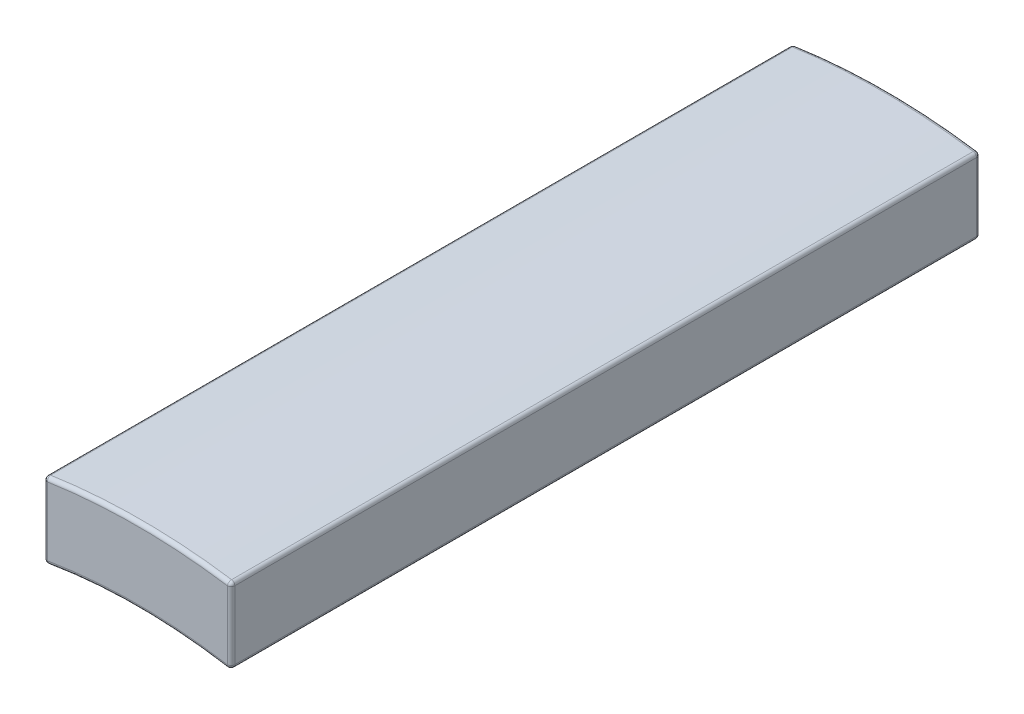
ISO-10303-21;
HEADER;
FILE_DESCRIPTION(('STEP AP214'),'2;1');
FILE_NAME('part.step','',(''),(''),'','','');
FILE_SCHEMA(('AUTOMOTIVE_DESIGN { 1 0 10303 214 1 1 1 1 }'));
ENDSEC;
DATA;
#1=APPLICATION_CONTEXT('core data for automotive mechanical design processes');
#2=APPLICATION_PROTOCOL_DEFINITION('international standard','automotive_design',2000,#1);
#3=PRODUCT_CONTEXT('',#1,'mechanical');
#4=PRODUCT('Part','Part','',(#3));
#5=PRODUCT_RELATED_PRODUCT_CATEGORY('part','',(#4));
#6=PRODUCT_DEFINITION_FORMATION('','',#4);
#7=PRODUCT_DEFINITION_CONTEXT('part definition',#1,'design');
#8=PRODUCT_DEFINITION('design','',#6,#7);
#9=PRODUCT_DEFINITION_SHAPE('','',#8);
#10=(LENGTH_UNIT() NAMED_UNIT(*) SI_UNIT(.MILLI.,.METRE.));
#11=(NAMED_UNIT(*) PLANE_ANGLE_UNIT() SI_UNIT($,.RADIAN.));
#12=(NAMED_UNIT(*) SI_UNIT($,.STERADIAN.) SOLID_ANGLE_UNIT());
#13=UNCERTAINTY_MEASURE_WITH_UNIT(LENGTH_MEASURE(1.E-05),#10,'distance_accuracy_value','');
#14=(GEOMETRIC_REPRESENTATION_CONTEXT(3) GLOBAL_UNCERTAINTY_ASSIGNED_CONTEXT((#13)) GLOBAL_UNIT_ASSIGNED_CONTEXT((#10,
#11,#12)) REPRESENTATION_CONTEXT('',''));
#15=CARTESIAN_POINT('',(0.,0.,0.));
#16=DIRECTION('',(0.,0.,1.));
#17=DIRECTION('',(1.,0.,0.));
#18=AXIS2_PLACEMENT_3D('',#15,#16,#17);
#19=CARTESIAN_POINT('',(2.4,14.3,0.1));
#20=DIRECTION('',(0.,1.,0.));
#21=DIRECTION('',(0.,0.,1.));
#22=AXIS2_PLACEMENT_3D('',#19,#20,#21);
#23=CYLINDRICAL_SURFACE('',#22,0.1);
#24=CARTESIAN_POINT('',(2.4,14.3,0.1));
#25=DIRECTION('',(0.,1.,0.));
#26=DIRECTION('',(0.,0.,1.));
#27=AXIS2_PLACEMENT_3D('',#24,#25,#26);
#28=CIRCLE('',#27,0.1);
#29=CARTESIAN_POINT('',(2.5,14.3,0.1));
#30=VERTEX_POINT('',#29);
#31=CARTESIAN_POINT('',(2.4,14.3,0.));
#32=VERTEX_POINT('',#31);
#33=EDGE_CURVE('E27',#30,#32,#28,.T.);
#34=ORIENTED_EDGE('',*,*,#33,.T.);
#35=DIRECTION('',(0.,-1.,0.));
#36=VECTOR('',#35,1.);
#37=CARTESIAN_POINT('',(2.4,14.3,0.));
#38=LINE('',#37,#36);
#39=CARTESIAN_POINT('',(2.4,16.1223447426235,0.));
#40=VERTEX_POINT('',#39);
#41=EDGE_CURVE('E218',#40,#32,#38,.T.);
#42=ORIENTED_EDGE('',*,*,#41,.F.);
#43=CARTESIAN_POINT('',(2.4,16.1223447426235,0.1));
#44=DIRECTION('',(0.,-1.,0.));
#45=DIRECTION('',(0.,0.,-1.));
#46=AXIS2_PLACEMENT_3D('',#43,#44,#45);
#47=CIRCLE('',#46,0.1);
#48=CARTESIAN_POINT('',(2.5,16.1223447426235,0.1));
#49=VERTEX_POINT('',#48);
#50=EDGE_CURVE('E11',#40,#49,#47,.T.);
#51=ORIENTED_EDGE('',*,*,#50,.T.);
#52=DIRECTION('',(0.,1.,0.));
#53=VECTOR('',#52,1.);
#54=CARTESIAN_POINT('',(2.5,14.3,0.1));
#55=LINE('',#54,#53);
#56=EDGE_CURVE('E275',#30,#49,#55,.T.);
#57=ORIENTED_EDGE('',*,*,#56,.F.);
#58=EDGE_LOOP('',(#34,#42,#51,#57));
#59=FACE_BOUND('',#58,.T.);
#60=ADVANCED_FACE('F16',(#59),#23,.T.);
#61=CARTESIAN_POINT('',(2.4,16.1223447426235,0.1));
#62=DIRECTION('',(0.,1.,0.));
#63=DIRECTION('',(1.,0.,0.));
#64=AXIS2_PLACEMENT_3D('',#61,#62,#63);
#65=SPHERICAL_SURFACE('',#64,0.1);
#66=CARTESIAN_POINT('',(2.4,16.1223447426235,0.1));
#67=DIRECTION('',(0.98910090445543,-0.147239263803684,0.));
#68=DIRECTION('',(0.147239263803684,0.98910090445543,0.));
#69=AXIS2_PLACEMENT_3D('',#66,#67,#68);
#70=CIRCLE('',#69,0.1);
#71=CARTESIAN_POINT('',(2.41472392638037,16.2212548330691,0.1));
#72=VERTEX_POINT('',#71);
#73=EDGE_CURVE('E155',#40,#72,#70,.T.);
#74=ORIENTED_EDGE('',*,*,#73,.T.);
#75=CARTESIAN_POINT('',(2.4,16.1223447426235,0.1));
#76=DIRECTION('',(0.,0.,1.));
#77=DIRECTION('',(-1.,0.,0.));
#78=AXIS2_PLACEMENT_3D('',#75,#76,#77);
#79=CIRCLE('',#78,0.1);
#80=EDGE_CURVE('E208',#49,#72,#79,.T.);
#81=ORIENTED_EDGE('',*,*,#80,.F.);
#82=ORIENTED_EDGE('',*,*,#50,.F.);
#83=EDGE_LOOP('',(#74,#81,#82));
#84=FACE_BOUND('',#83,.T.);
#85=ADVANCED_FACE('F636',(#84),#65,.T.);
#86=CARTESIAN_POINT('',(2.4,14.3,0.1));
#87=DIRECTION('',(0.,1.,0.));
#88=DIRECTION('',(1.,0.,0.));
#89=AXIS2_PLACEMENT_3D('',#86,#87,#88);
#90=SPHERICAL_SURFACE('',#89,0.1);
#91=CARTESIAN_POINT('',(2.4,14.3,0.1));
#92=DIRECTION('',(0.,0.,1.));
#93=DIRECTION('',(-1.,0.,0.));
#94=AXIS2_PLACEMENT_3D('',#91,#92,#93);
#95=CIRCLE('',#94,0.1);
#96=CARTESIAN_POINT('',(2.38344827586207,14.2013793103448,0.1));
#97=VERTEX_POINT('',#96);
#98=EDGE_CURVE('E172',#97,#30,#95,.T.);
#99=ORIENTED_EDGE('',*,*,#98,.F.);
#100=CARTESIAN_POINT('',(2.4,14.3,0.1));
#101=DIRECTION('',(0.986206896551724,-0.165517241379312,0.));
#102=DIRECTION('',(0.165517241379312,0.986206896551724,0.));
#103=AXIS2_PLACEMENT_3D('',#100,#101,#102);
#104=CIRCLE('',#103,0.1);
#105=EDGE_CURVE('E144',#97,#32,#104,.T.);
#106=ORIENTED_EDGE('',*,*,#105,.T.);
#107=ORIENTED_EDGE('',*,*,#33,.F.);
#108=EDGE_LOOP('',(#99,#106,#107));
#109=FACE_BOUND('',#108,.T.);
#110=ADVANCED_FACE('F173',(#109),#90,.T.);
#111=CARTESIAN_POINT('',(0.,0.,0.1));
#112=DIRECTION('',(0.,0.,1.));
#113=DIRECTION('',(1.,0.,0.));
#114=AXIS2_PLACEMENT_3D('',#111,#112,#113);
#115=TOROIDAL_SURFACE('',#114,16.3,0.1);
#116=CARTESIAN_POINT('',(-2.4,16.1223447426235,0.1));
#117=DIRECTION('',(0.98910090445543,0.14723926380368,0.));
#118=DIRECTION('',(-0.14723926380368,0.98910090445543,0.));
#119=AXIS2_PLACEMENT_3D('',#116,#117,#118);
#120=CIRCLE('',#119,0.1);
#121=CARTESIAN_POINT('',(-2.4,16.1223447426235,0.));
#122=VERTEX_POINT('',#121);
#123=CARTESIAN_POINT('',(-2.41472392638037,16.2212548330691,0.1));
#124=VERTEX_POINT('',#123);
#125=EDGE_CURVE('E156',#122,#124,#120,.T.);
#126=ORIENTED_EDGE('',*,*,#125,.T.);
#127=CARTESIAN_POINT('',(0.,0.,0.1));
#128=DIRECTION('',(0.,0.,1.));
#129=DIRECTION('',(1.,0.,0.));
#130=AXIS2_PLACEMENT_3D('',#127,#128,#129);
#131=CIRCLE('',#130,16.4);
#132=EDGE_CURVE('E266',#72,#124,#131,.T.);
#133=ORIENTED_EDGE('',*,*,#132,.F.);
#134=ORIENTED_EDGE('',*,*,#73,.F.);
#135=CARTESIAN_POINT('',(0.,0.,0.));
#136=DIRECTION('',(0.,0.,-1.));
#137=DIRECTION('',(1.,0.,0.));
#138=AXIS2_PLACEMENT_3D('',#135,#136,#137);
#139=CIRCLE('',#138,16.3);
#140=EDGE_CURVE('E214',#122,#40,#139,.T.);
#141=ORIENTED_EDGE('',*,*,#140,.F.);
#142=EDGE_LOOP('',(#126,#133,#134,#141));
#143=FACE_BOUND('',#142,.T.);
#144=ADVANCED_FACE('F547',(#143),#115,.T.);
#145=CARTESIAN_POINT('',(0.,0.,0.1));
#146=DIRECTION('',(0.,0.,1.));
#147=DIRECTION('',(1.,0.,0.));
#148=AXIS2_PLACEMENT_3D('',#145,#146,#147);
#149=TOROIDAL_SURFACE('',#148,14.5,0.1);
#150=CARTESIAN_POINT('',(-2.4,14.3,0.1));
#151=DIRECTION('',(0.986206896551723,0.165517241379316,0.));
#152=DIRECTION('',(-0.165517241379316,0.986206896551723,0.));
#153=AXIS2_PLACEMENT_3D('',#150,#151,#152);
#154=CIRCLE('',#153,0.1);
#155=CARTESIAN_POINT('',(-2.38344827586207,14.2013793103448,0.1));
#156=VERTEX_POINT('',#155);
#157=CARTESIAN_POINT('',(-2.4,14.3,0.));
#158=VERTEX_POINT('',#157);
#159=EDGE_CURVE('E20',#156,#158,#154,.T.);
#160=ORIENTED_EDGE('',*,*,#159,.T.);
#161=CARTESIAN_POINT('',(0.,0.,0.));
#162=DIRECTION('',(0.,0.,1.));
#163=DIRECTION('',(1.,0.,0.));
#164=AXIS2_PLACEMENT_3D('',#161,#162,#163);
#165=CIRCLE('',#164,14.5);
#166=EDGE_CURVE('E150',#32,#158,#165,.T.);
#167=ORIENTED_EDGE('',*,*,#166,.F.);
#168=ORIENTED_EDGE('',*,*,#105,.F.);
#169=CARTESIAN_POINT('',(0.,0.,0.1));
#170=DIRECTION('',(0.,0.,-1.));
#171=DIRECTION('',(1.,0.,0.));
#172=AXIS2_PLACEMENT_3D('',#169,#170,#171);
#173=CIRCLE('',#172,14.4);
#174=EDGE_CURVE('E147',#156,#97,#173,.T.);
#175=ORIENTED_EDGE('',*,*,#174,.F.);
#176=EDGE_LOOP('',(#160,#167,#168,#175));
#177=FACE_BOUND('',#176,.T.);
#178=ADVANCED_FACE('F146',(#177),#149,.T.);
#179=CARTESIAN_POINT('',(-2.4,16.1223447426235,0.1));
#180=DIRECTION('',(0.,1.,0.));
#181=DIRECTION('',(1.,0.,0.));
#182=AXIS2_PLACEMENT_3D('',#179,#180,#181);
#183=SPHERICAL_SURFACE('',#182,0.1);
#184=CARTESIAN_POINT('',(-2.4,16.1223447426235,0.1));
#185=DIRECTION('',(0.,1.,0.));
#186=DIRECTION('',(0.,0.,1.));
#187=AXIS2_PLACEMENT_3D('',#184,#185,#186);
#188=CIRCLE('',#187,0.1);
#189=CARTESIAN_POINT('',(-2.5,16.1223447426235,0.1));
#190=VERTEX_POINT('',#189);
#191=EDGE_CURVE('E250',#122,#190,#188,.T.);
#192=ORIENTED_EDGE('',*,*,#191,.T.);
#193=CARTESIAN_POINT('',(-2.4,16.1223447426235,0.1));
#194=DIRECTION('',(0.,0.,1.));
#195=DIRECTION('',(-1.,0.,0.));
#196=AXIS2_PLACEMENT_3D('',#193,#194,#195);
#197=CIRCLE('',#196,0.1);
#198=EDGE_CURVE('E226',#124,#190,#197,.T.);
#199=ORIENTED_EDGE('',*,*,#198,.F.);
#200=ORIENTED_EDGE('',*,*,#125,.F.);
#201=EDGE_LOOP('',(#192,#199,#200));
#202=FACE_BOUND('',#201,.T.);
#203=ADVANCED_FACE('F560',(#202),#183,.T.);
#204=CARTESIAN_POINT('',(-2.4,14.3,0.1));
#205=DIRECTION('',(0.,1.,0.));
#206=DIRECTION('',(1.,0.,0.));
#207=AXIS2_PLACEMENT_3D('',#204,#205,#206);
#208=SPHERICAL_SURFACE('',#207,0.1);
#209=CARTESIAN_POINT('',(-2.4,14.3,0.1));
#210=DIRECTION('',(0.,0.,1.));
#211=DIRECTION('',(-1.,0.,0.));
#212=AXIS2_PLACEMENT_3D('',#209,#210,#211);
#213=CIRCLE('',#212,0.1);
#214=CARTESIAN_POINT('',(-2.5,14.3,0.1));
#215=VERTEX_POINT('',#214);
#216=EDGE_CURVE('E243',#215,#156,#213,.T.);
#217=ORIENTED_EDGE('',*,*,#216,.F.);
#218=CARTESIAN_POINT('',(-2.4,14.3,0.1));
#219=DIRECTION('',(0.,-1.,0.));
#220=DIRECTION('',(0.,0.,-1.));
#221=AXIS2_PLACEMENT_3D('',#218,#219,#220);
#222=CIRCLE('',#221,0.1);
#223=EDGE_CURVE('E212',#215,#158,#222,.T.);
#224=ORIENTED_EDGE('',*,*,#223,.T.);
#225=ORIENTED_EDGE('',*,*,#159,.F.);
#226=EDGE_LOOP('',(#217,#224,#225));
#227=FACE_BOUND('',#226,.T.);
#228=ADVANCED_FACE('F346',(#227),#208,.T.);
#229=CARTESIAN_POINT('',(-2.4,14.3,0.1));
#230=DIRECTION('',(0.,-1.,0.));
#231=DIRECTION('',(0.,0.,-1.));
#232=AXIS2_PLACEMENT_3D('',#229,#230,#231);
#233=CYLINDRICAL_SURFACE('',#232,0.1);
#234=ORIENTED_EDGE('',*,*,#223,.F.);
#235=DIRECTION('',(0.,-1.,0.));
#236=VECTOR('',#235,1.);
#237=CARTESIAN_POINT('',(-2.5,14.3,0.1));
#238=LINE('',#237,#236);
#239=EDGE_CURVE('E249',#190,#215,#238,.T.);
#240=ORIENTED_EDGE('',*,*,#239,.F.);
#241=ORIENTED_EDGE('',*,*,#191,.F.);
#242=DIRECTION('',(0.,1.,0.));
#243=VECTOR('',#242,1.);
#244=CARTESIAN_POINT('',(-2.4,14.3,0.));
#245=LINE('',#244,#243);
#246=EDGE_CURVE('E197',#158,#122,#245,.T.);
#247=ORIENTED_EDGE('',*,*,#246,.F.);
#248=EDGE_LOOP('',(#234,#240,#241,#247));
#249=FACE_BOUND('',#248,.T.);
#250=ADVANCED_FACE('F559',(#249),#233,.T.);
#251=CARTESIAN_POINT('',(0.,0.,19.9));
#252=DIRECTION('',(0.,0.,1.));
#253=DIRECTION('',(1.,0.,0.));
#254=AXIS2_PLACEMENT_3D('',#251,#252,#253);
#255=TOROIDAL_SURFACE('',#254,14.5,0.1);
#256=CARTESIAN_POINT('',(-2.4,14.3,19.9));
#257=DIRECTION('',(0.986206896551723,0.165517241379316,0.));
#258=DIRECTION('',(-0.165517241379316,0.986206896551723,0.));
#259=AXIS2_PLACEMENT_3D('',#256,#257,#258);
#260=CIRCLE('',#259,0.1);
#261=CARTESIAN_POINT('',(-2.4,14.3,20.));
#262=VERTEX_POINT('',#261);
#263=CARTESIAN_POINT('',(-2.38344827586207,14.2013793103448,19.9));
#264=VERTEX_POINT('',#263);
#265=EDGE_CURVE('E213',#262,#264,#260,.T.);
#266=ORIENTED_EDGE('',*,*,#265,.T.);
#267=CARTESIAN_POINT('',(0.,0.,19.9));
#268=DIRECTION('',(0.,0.,1.));
#269=DIRECTION('',(1.,0.,0.));
#270=AXIS2_PLACEMENT_3D('',#267,#268,#269);
#271=CIRCLE('',#270,14.4);
#272=CARTESIAN_POINT('',(2.38344827586207,14.2013793103448,19.9));
#273=VERTEX_POINT('',#272);
#274=EDGE_CURVE('E168',#273,#264,#271,.T.);
#275=ORIENTED_EDGE('',*,*,#274,.F.);
#276=CARTESIAN_POINT('',(2.4,14.3,19.9));
#277=DIRECTION('',(-0.986206896551725,0.165517241379303,0.));
#278=DIRECTION('',(-0.165517241379303,-0.986206896551725,0.));
#279=AXIS2_PLACEMENT_3D('',#276,#277,#278);
#280=CIRCLE('',#279,0.1);
#281=CARTESIAN_POINT('',(2.4,14.3,20.));
#282=VERTEX_POINT('',#281);
#283=EDGE_CURVE('E75',#273,#282,#280,.T.);
#284=ORIENTED_EDGE('',*,*,#283,.T.);
#285=CARTESIAN_POINT('',(0.,0.,20.));
#286=DIRECTION('',(0.,0.,-1.));
#287=DIRECTION('',(1.,0.,0.));
#288=AXIS2_PLACEMENT_3D('',#285,#286,#287);
#289=CIRCLE('',#288,14.5);
#290=EDGE_CURVE('E198',#262,#282,#289,.T.);
#291=ORIENTED_EDGE('',*,*,#290,.F.);
#292=EDGE_LOOP('',(#266,#275,#284,#291));
#293=FACE_BOUND('',#292,.T.);
#294=ADVANCED_FACE('F340',(#293),#255,.T.);
#295=CARTESIAN_POINT('',(2.4,14.3,19.9));
#296=DIRECTION('',(0.,1.,0.));
#297=DIRECTION('',(1.,0.,0.));
#298=AXIS2_PLACEMENT_3D('',#295,#296,#297);
#299=SPHERICAL_SURFACE('',#298,0.1);
#300=CARTESIAN_POINT('',(2.4,14.3,19.9));
#301=DIRECTION('',(0.,0.,-1.));
#302=DIRECTION('',(-1.,0.,0.));
#303=AXIS2_PLACEMENT_3D('',#300,#301,#302);
#304=CIRCLE('',#303,0.1);
#305=CARTESIAN_POINT('',(2.5,14.3,19.9));
#306=VERTEX_POINT('',#305);
#307=EDGE_CURVE('E183',#306,#273,#304,.T.);
#308=ORIENTED_EDGE('',*,*,#307,.F.);
#309=CARTESIAN_POINT('',(2.4,14.3,19.9));
#310=DIRECTION('',(0.,-1.,0.));
#311=DIRECTION('',(0.,0.,-1.));
#312=AXIS2_PLACEMENT_3D('',#309,#310,#311);
#313=CIRCLE('',#312,0.1);
#314=EDGE_CURVE('E234',#306,#282,#313,.T.);
#315=ORIENTED_EDGE('',*,*,#314,.T.);
#316=ORIENTED_EDGE('',*,*,#283,.F.);
#317=EDGE_LOOP('',(#308,#315,#316));
#318=FACE_BOUND('',#317,.T.);
#319=ADVANCED_FACE('F685',(#318),#299,.T.);
#320=CARTESIAN_POINT('',(-2.4,14.3,19.9));
#321=DIRECTION('',(0.,1.,0.));
#322=DIRECTION('',(1.,0.,0.));
#323=AXIS2_PLACEMENT_3D('',#320,#321,#322);
#324=SPHERICAL_SURFACE('',#323,0.1);
#325=CARTESIAN_POINT('',(-2.4,14.3,19.9));
#326=DIRECTION('',(0.,-1.,0.));
#327=DIRECTION('',(0.,0.,-1.));
#328=AXIS2_PLACEMENT_3D('',#325,#326,#327);
#329=CIRCLE('',#328,0.1);
#330=CARTESIAN_POINT('',(-2.5,14.3,19.9));
#331=VERTEX_POINT('',#330);
#332=EDGE_CURVE('E257',#262,#331,#329,.T.);
#333=ORIENTED_EDGE('',*,*,#332,.T.);
#334=CARTESIAN_POINT('',(-2.4,14.3,19.9));
#335=DIRECTION('',(0.,0.,-1.));
#336=DIRECTION('',(-1.,0.,0.));
#337=AXIS2_PLACEMENT_3D('',#334,#335,#336);
#338=CIRCLE('',#337,0.1);
#339=EDGE_CURVE('E169',#264,#331,#338,.T.);
#340=ORIENTED_EDGE('',*,*,#339,.F.);
#341=ORIENTED_EDGE('',*,*,#265,.F.);
#342=EDGE_LOOP('',(#333,#340,#341));
#343=FACE_BOUND('',#342,.T.);
#344=ADVANCED_FACE('F341',(#343),#324,.T.);
#345=CARTESIAN_POINT('',(2.4,14.3,19.9));
#346=DIRECTION('',(0.,-1.,0.));
#347=DIRECTION('',(0.,0.,-1.));
#348=AXIS2_PLACEMENT_3D('',#345,#346,#347);
#349=CYLINDRICAL_SURFACE('',#348,0.1);
#350=CARTESIAN_POINT('',(2.4,16.1223447426235,19.9));
#351=DIRECTION('',(0.,-1.,0.));
#352=DIRECTION('',(0.,0.,-1.));
#353=AXIS2_PLACEMENT_3D('',#350,#351,#352);
#354=CIRCLE('',#353,0.1);
#355=CARTESIAN_POINT('',(2.5,16.1223447426235,19.9));
#356=VERTEX_POINT('',#355);
#357=CARTESIAN_POINT('',(2.4,16.1223447426235,20.));
#358=VERTEX_POINT('',#357);
#359=EDGE_CURVE('E58',#356,#358,#354,.T.);
#360=ORIENTED_EDGE('',*,*,#359,.T.);
#361=DIRECTION('',(0.,1.,0.));
#362=VECTOR('',#361,1.);
#363=CARTESIAN_POINT('',(2.4,16.1223447426235,20.));
#364=LINE('',#363,#362);
#365=EDGE_CURVE('E202',#282,#358,#364,.T.);
#366=ORIENTED_EDGE('',*,*,#365,.F.);
#367=ORIENTED_EDGE('',*,*,#314,.F.);
#368=DIRECTION('',(0.,-1.,0.));
#369=VECTOR('',#368,1.);
#370=CARTESIAN_POINT('',(2.5,14.3,19.9));
#371=LINE('',#370,#369);
#372=EDGE_CURVE('E204',#356,#306,#371,.T.);
#373=ORIENTED_EDGE('',*,*,#372,.F.);
#374=EDGE_LOOP('',(#360,#366,#367,#373));
#375=FACE_BOUND('',#374,.T.);
#376=ADVANCED_FACE('F645',(#375),#349,.T.);
#377=CARTESIAN_POINT('',(-2.4,14.3,19.9));
#378=DIRECTION('',(0.,1.,0.));
#379=DIRECTION('',(0.,0.,1.));
#380=AXIS2_PLACEMENT_3D('',#377,#378,#379);
#381=CYLINDRICAL_SURFACE('',#380,0.1);
#382=CARTESIAN_POINT('',(-2.4,16.1223447426235,19.9));
#383=DIRECTION('',(0.,-1.,0.));
#384=DIRECTION('',(0.,0.,-1.));
#385=AXIS2_PLACEMENT_3D('',#382,#383,#384);
#386=CIRCLE('',#385,0.1);
#387=CARTESIAN_POINT('',(-2.4,16.1223447426235,20.));
#388=VERTEX_POINT('',#387);
#389=CARTESIAN_POINT('',(-2.5,16.1223447426235,19.9));
#390=VERTEX_POINT('',#389);
#391=EDGE_CURVE('E192',#388,#390,#386,.T.);
#392=ORIENTED_EDGE('',*,*,#391,.T.);
#393=DIRECTION('',(0.,1.,0.));
#394=VECTOR('',#393,1.);
#395=CARTESIAN_POINT('',(-2.5,16.1223447426235,19.9));
#396=LINE('',#395,#394);
#397=EDGE_CURVE('E239',#331,#390,#396,.T.);
#398=ORIENTED_EDGE('',*,*,#397,.F.);
#399=ORIENTED_EDGE('',*,*,#332,.F.);
#400=DIRECTION('',(0.,-1.,0.));
#401=VECTOR('',#400,1.);
#402=CARTESIAN_POINT('',(-2.4,14.3,20.));
#403=LINE('',#402,#401);
#404=EDGE_CURVE('E203',#388,#262,#403,.T.);
#405=ORIENTED_EDGE('',*,*,#404,.F.);
#406=EDGE_LOOP('',(#392,#398,#399,#405));
#407=FACE_BOUND('',#406,.T.);
#408=ADVANCED_FACE('F335',(#407),#381,.T.);
#409=CARTESIAN_POINT('',(2.4,16.1223447426235,19.9));
#410=DIRECTION('',(0.,1.,0.));
#411=DIRECTION('',(1.,0.,0.));
#412=AXIS2_PLACEMENT_3D('',#409,#410,#411);
#413=SPHERICAL_SURFACE('',#412,0.1);
#414=CARTESIAN_POINT('',(2.4,16.1223447426235,19.9));
#415=DIRECTION('',(0.,0.,-1.));
#416=DIRECTION('',(-1.,0.,0.));
#417=AXIS2_PLACEMENT_3D('',#414,#415,#416);
#418=CIRCLE('',#417,0.1);
#419=CARTESIAN_POINT('',(2.41472392638037,16.2212548330691,19.9));
#420=VERTEX_POINT('',#419);
#421=EDGE_CURVE('E270',#420,#356,#418,.T.);
#422=ORIENTED_EDGE('',*,*,#421,.F.);
#423=CARTESIAN_POINT('',(2.4,16.1223447426235,19.9));
#424=DIRECTION('',(0.98910090445543,-0.14723926380368,0.));
#425=DIRECTION('',(0.14723926380368,0.98910090445543,0.));
#426=AXIS2_PLACEMENT_3D('',#423,#424,#425);
#427=CIRCLE('',#426,0.1);
#428=EDGE_CURVE('E193',#420,#358,#427,.T.);
#429=ORIENTED_EDGE('',*,*,#428,.T.);
#430=ORIENTED_EDGE('',*,*,#359,.F.);
#431=EDGE_LOOP('',(#422,#429,#430));
#432=FACE_BOUND('',#431,.T.);
#433=ADVANCED_FACE('F627',(#432),#413,.T.);
#434=CARTESIAN_POINT('',(-2.4,16.1223447426235,19.9));
#435=DIRECTION('',(0.,1.,0.));
#436=DIRECTION('',(1.,0.,0.));
#437=AXIS2_PLACEMENT_3D('',#434,#435,#436);
#438=SPHERICAL_SURFACE('',#437,0.1);
#439=CARTESIAN_POINT('',(-2.4,16.1223447426235,19.9));
#440=DIRECTION('',(-0.98910090445543,-0.14723926380368,0.));
#441=DIRECTION('',(0.14723926380368,-0.98910090445543,0.));
#442=AXIS2_PLACEMENT_3D('',#439,#440,#441);
#443=CIRCLE('',#442,0.1);
#444=CARTESIAN_POINT('',(-2.41472392638037,16.2212548330691,19.9));
#445=VERTEX_POINT('',#444);
#446=EDGE_CURVE('E190',#388,#445,#443,.T.);
#447=ORIENTED_EDGE('',*,*,#446,.T.);
#448=CARTESIAN_POINT('',(-2.4,16.1223447426235,19.9));
#449=DIRECTION('',(0.,0.,-1.));
#450=DIRECTION('',(-1.,0.,0.));
#451=AXIS2_PLACEMENT_3D('',#448,#449,#450);
#452=CIRCLE('',#451,0.1);
#453=EDGE_CURVE('E245',#390,#445,#452,.T.);
#454=ORIENTED_EDGE('',*,*,#453,.F.);
#455=ORIENTED_EDGE('',*,*,#391,.F.);
#456=EDGE_LOOP('',(#447,#454,#455));
#457=FACE_BOUND('',#456,.T.);
#458=ADVANCED_FACE('F596',(#457),#438,.T.);
#459=CARTESIAN_POINT('',(0.,0.,19.9));
#460=DIRECTION('',(0.,0.,1.));
#461=DIRECTION('',(1.,0.,0.));
#462=AXIS2_PLACEMENT_3D('',#459,#460,#461);
#463=TOROIDAL_SURFACE('',#462,16.3,0.1);
#464=ORIENTED_EDGE('',*,*,#428,.F.);
#465=CARTESIAN_POINT('',(0.,0.,19.9));
#466=DIRECTION('',(0.,0.,-1.));
#467=DIRECTION('',(1.,0.,0.));
#468=AXIS2_PLACEMENT_3D('',#465,#466,#467);
#469=CIRCLE('',#468,16.4);
#470=EDGE_CURVE('E223',#445,#420,#469,.T.);
#471=ORIENTED_EDGE('',*,*,#470,.F.);
#472=ORIENTED_EDGE('',*,*,#446,.F.);
#473=CARTESIAN_POINT('',(0.,0.,20.));
#474=DIRECTION('',(0.,0.,1.));
#475=DIRECTION('',(1.,0.,0.));
#476=AXIS2_PLACEMENT_3D('',#473,#474,#475);
#477=CIRCLE('',#476,16.3);
#478=EDGE_CURVE('E219',#358,#388,#477,.T.);
#479=ORIENTED_EDGE('',*,*,#478,.F.);
#480=EDGE_LOOP('',(#464,#471,#472,#479));
#481=FACE_BOUND('',#480,.T.);
#482=ADVANCED_FACE('F592',(#481),#463,.T.);
#483=CARTESIAN_POINT('',(2.4,14.3,0.));
#484=DIRECTION('',(0.,0.,1.));
#485=DIRECTION('',(1.,0.,0.));
#486=AXIS2_PLACEMENT_3D('',#483,#484,#485);
#487=PLANE('',#486);
#488=ORIENTED_EDGE('',*,*,#140,.T.);
#489=ORIENTED_EDGE('',*,*,#41,.T.);
#490=ORIENTED_EDGE('',*,*,#166,.T.);
#491=ORIENTED_EDGE('',*,*,#246,.T.);
#492=EDGE_LOOP('',(#488,#489,#490,#491));
#493=FACE_BOUND('',#492,.T.);
#494=ADVANCED_FACE('F578',(#493),#487,.F.);
#495=CARTESIAN_POINT('',(2.4,14.3,20.));
#496=DIRECTION('',(0.,0.,1.));
#497=DIRECTION('',(1.,0.,0.));
#498=AXIS2_PLACEMENT_3D('',#495,#496,#497);
#499=PLANE('',#498);
#500=ORIENTED_EDGE('',*,*,#404,.T.);
#501=ORIENTED_EDGE('',*,*,#290,.T.);
#502=ORIENTED_EDGE('',*,*,#365,.T.);
#503=ORIENTED_EDGE('',*,*,#478,.T.);
#504=EDGE_LOOP('',(#500,#501,#502,#503));
#505=FACE_BOUND('',#504,.T.);
#506=ADVANCED_FACE('F331',(#505),#499,.T.);
#507=CARTESIAN_POINT('',(0.,0.,20.));
#508=DIRECTION('',(0.,0.,-1.));
#509=DIRECTION('',(-1.,0.,0.));
#510=AXIS2_PLACEMENT_3D('',#507,#508,#509);
#511=CYLINDRICAL_SURFACE('',#510,14.4);
#512=DIRECTION('',(0.,0.,-1.));
#513=VECTOR('',#512,1.);
#514=CARTESIAN_POINT('',(-2.38344827586207,14.2013793103448,20.));
#515=LINE('',#514,#513);
#516=EDGE_CURVE('E165',#264,#156,#515,.T.);
#517=ORIENTED_EDGE('',*,*,#516,.T.);
#518=ORIENTED_EDGE('',*,*,#174,.T.);
#519=DIRECTION('',(0.,0.,-1.));
#520=VECTOR('',#519,1.);
#521=CARTESIAN_POINT('',(2.38344827586207,14.2013793103448,20.));
#522=LINE('',#521,#520);
#523=EDGE_CURVE('E163',#273,#97,#522,.T.);
#524=ORIENTED_EDGE('',*,*,#523,.F.);
#525=ORIENTED_EDGE('',*,*,#274,.T.);
#526=EDGE_LOOP('',(#517,#518,#524,#525));
#527=FACE_BOUND('',#526,.T.);
#528=ADVANCED_FACE('F160',(#527),#511,.F.);
#529=CARTESIAN_POINT('',(-2.4,14.3,20.));
#530=DIRECTION('',(0.,0.,-1.));
#531=DIRECTION('',(-1.,0.,0.));
#532=AXIS2_PLACEMENT_3D('',#529,#530,#531);
#533=CYLINDRICAL_SURFACE('',#532,0.1);
#534=DIRECTION('',(0.,0.,-1.));
#535=VECTOR('',#534,1.);
#536=CARTESIAN_POINT('',(-2.5,14.3,20.));
#537=LINE('',#536,#535);
#538=EDGE_CURVE('E244',#331,#215,#537,.T.);
#539=ORIENTED_EDGE('',*,*,#538,.T.);
#540=ORIENTED_EDGE('',*,*,#216,.T.);
#541=ORIENTED_EDGE('',*,*,#516,.F.);
#542=ORIENTED_EDGE('',*,*,#339,.T.);
#543=EDGE_LOOP('',(#539,#540,#541,#542));
#544=FACE_BOUND('',#543,.T.);
#545=ADVANCED_FACE('F343',(#544),#533,.T.);
#546=CARTESIAN_POINT('',(-2.5,14.3,20.));
#547=DIRECTION('',(1.,0.,0.));
#548=DIRECTION('',(0.,1.,0.));
#549=AXIS2_PLACEMENT_3D('',#546,#547,#548);
#550=PLANE('',#549);
#551=DIRECTION('',(0.,0.,-1.));
#552=VECTOR('',#551,1.);
#553=CARTESIAN_POINT('',(-2.5,16.1223447426235,20.));
#554=LINE('',#553,#552);
#555=EDGE_CURVE('E238',#390,#190,#554,.T.);
#556=ORIENTED_EDGE('',*,*,#555,.T.);
#557=ORIENTED_EDGE('',*,*,#239,.T.);
#558=ORIENTED_EDGE('',*,*,#538,.F.);
#559=ORIENTED_EDGE('',*,*,#397,.T.);
#560=EDGE_LOOP('',(#556,#557,#558,#559));
#561=FACE_BOUND('',#560,.T.);
#562=ADVANCED_FACE('F700',(#561),#550,.F.);
#563=CARTESIAN_POINT('',(-2.4,16.1223447426235,20.));
#564=DIRECTION('',(0.,0.,-1.));
#565=DIRECTION('',(-1.,0.,0.));
#566=AXIS2_PLACEMENT_3D('',#563,#564,#565);
#567=CYLINDRICAL_SURFACE('',#566,0.1);
#568=DIRECTION('',(0.,0.,-1.));
#569=VECTOR('',#568,1.);
#570=CARTESIAN_POINT('',(-2.41472392638037,16.2212548330691,20.));
#571=LINE('',#570,#569);
#572=EDGE_CURVE('E227',#445,#124,#571,.T.);
#573=ORIENTED_EDGE('',*,*,#572,.T.);
#574=ORIENTED_EDGE('',*,*,#198,.T.);
#575=ORIENTED_EDGE('',*,*,#555,.F.);
#576=ORIENTED_EDGE('',*,*,#453,.T.);
#577=EDGE_LOOP('',(#573,#574,#575,#576));
#578=FACE_BOUND('',#577,.T.);
#579=ADVANCED_FACE('F18',(#578),#567,.T.);
#580=CARTESIAN_POINT('',(0.,0.,20.));
#581=DIRECTION('',(0.,0.,-1.));
#582=DIRECTION('',(-1.,0.,0.));
#583=AXIS2_PLACEMENT_3D('',#580,#581,#582);
#584=CYLINDRICAL_SURFACE('',#583,16.4);
#585=DIRECTION('',(0.,0.,-1.));
#586=VECTOR('',#585,1.);
#587=CARTESIAN_POINT('',(2.41472392638037,16.2212548330691,20.));
#588=LINE('',#587,#586);
#589=EDGE_CURVE('E290',#420,#72,#588,.T.);
#590=ORIENTED_EDGE('',*,*,#589,.T.);
#591=ORIENTED_EDGE('',*,*,#132,.T.);
#592=ORIENTED_EDGE('',*,*,#572,.F.);
#593=ORIENTED_EDGE('',*,*,#470,.T.);
#594=EDGE_LOOP('',(#590,#591,#592,#593));
#595=FACE_BOUND('',#594,.T.);
#596=ADVANCED_FACE('F586',(#595),#584,.T.);
#597=CARTESIAN_POINT('',(2.4,16.1223447426235,20.));
#598=DIRECTION('',(0.,0.,-1.));
#599=DIRECTION('',(-1.,0.,0.));
#600=AXIS2_PLACEMENT_3D('',#597,#598,#599);
#601=CYLINDRICAL_SURFACE('',#600,0.1);
#602=DIRECTION('',(0.,0.,-1.));
#603=VECTOR('',#602,1.);
#604=CARTESIAN_POINT('',(2.5,16.1223447426235,20.));
#605=LINE('',#604,#603);
#606=EDGE_CURVE('E209',#356,#49,#605,.T.);
#607=ORIENTED_EDGE('',*,*,#606,.T.);
#608=ORIENTED_EDGE('',*,*,#80,.T.);
#609=ORIENTED_EDGE('',*,*,#589,.F.);
#610=ORIENTED_EDGE('',*,*,#421,.T.);
#611=EDGE_LOOP('',(#607,#608,#609,#610));
#612=FACE_BOUND('',#611,.T.);
#613=ADVANCED_FACE('F569',(#612),#601,.T.);
#614=CARTESIAN_POINT('',(2.5,14.3,20.));
#615=DIRECTION('',(-1.,0.,0.));
#616=DIRECTION('',(0.,0.,1.));
#617=AXIS2_PLACEMENT_3D('',#614,#615,#616);
#618=PLANE('',#617);
#619=DIRECTION('',(0.,0.,-1.));
#620=VECTOR('',#619,1.);
#621=CARTESIAN_POINT('',(2.5,14.3,20.));
#622=LINE('',#621,#620);
#623=EDGE_CURVE('E178',#306,#30,#622,.T.);
#624=ORIENTED_EDGE('',*,*,#623,.T.);
#625=ORIENTED_EDGE('',*,*,#56,.T.);
#626=ORIENTED_EDGE('',*,*,#606,.F.);
#627=ORIENTED_EDGE('',*,*,#372,.T.);
#628=EDGE_LOOP('',(#624,#625,#626,#627));
#629=FACE_BOUND('',#628,.T.);
#630=ADVANCED_FACE('F565',(#629),#618,.F.);
#631=CARTESIAN_POINT('',(2.4,14.3,20.));
#632=DIRECTION('',(0.,0.,-1.));
#633=DIRECTION('',(-1.,0.,0.));
#634=AXIS2_PLACEMENT_3D('',#631,#632,#633);
#635=CYLINDRICAL_SURFACE('',#634,0.1);
#636=ORIENTED_EDGE('',*,*,#523,.T.);
#637=ORIENTED_EDGE('',*,*,#98,.T.);
#638=ORIENTED_EDGE('',*,*,#623,.F.);
#639=ORIENTED_EDGE('',*,*,#307,.T.);
#640=EDGE_LOOP('',(#636,#637,#638,#639));
#641=FACE_BOUND('',#640,.T.);
#642=ADVANCED_FACE('F181',(#641),#635,.T.);
#643=CLOSED_SHELL('',(#60,#85,#110,#144,#178,#203,#228,#250,#294,#319,#344,#376,#408,#433,#458,
#482,#494,#506,#528,#545,#562,#579,#596,#613,#630,#642));
#644=MANIFOLD_SOLID_BREP('B1',#643);
#645=ADVANCED_BREP_SHAPE_REPRESENTATION('',(#18,#644),#14);
#646=SHAPE_DEFINITION_REPRESENTATION(#9,#645);
ENDSEC;
END-ISO-10303-21;
